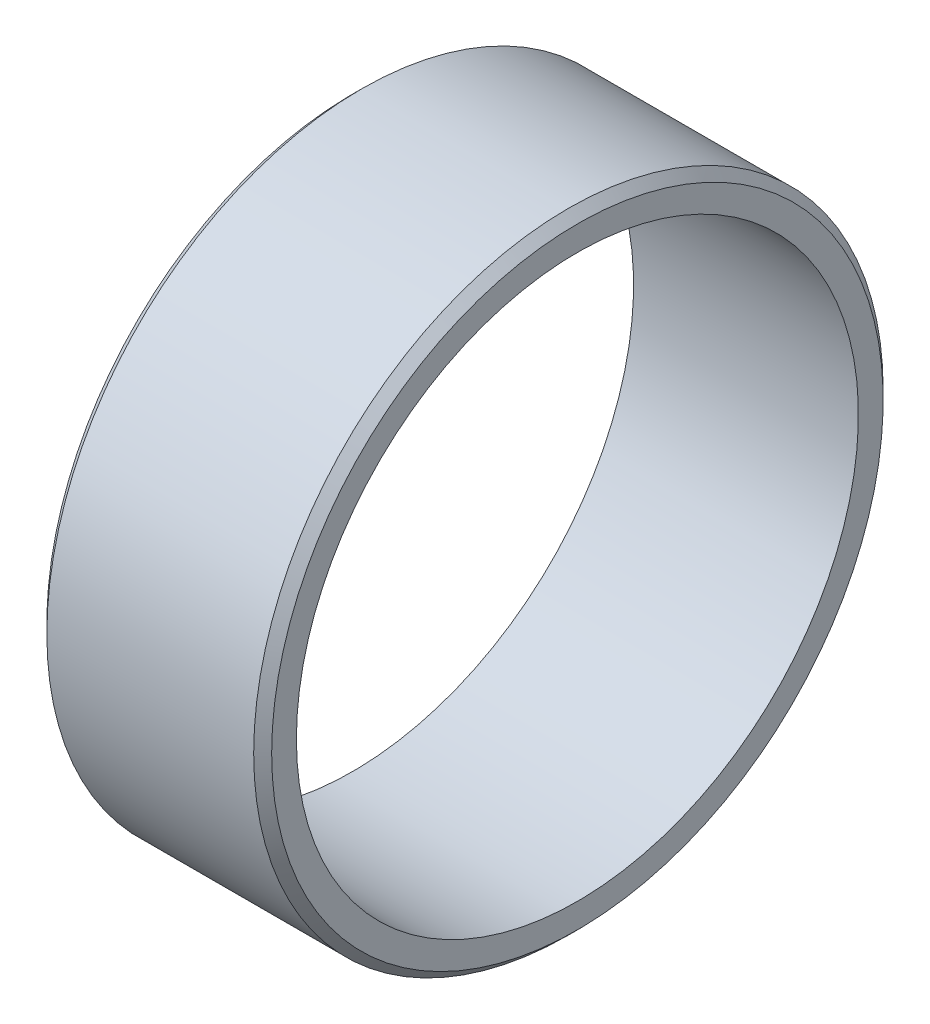
ISO-10303-21;
HEADER;
FILE_DESCRIPTION(('STEP AP214'),'2;1');
FILE_NAME('part.step','',(''),(''),'','','');
FILE_SCHEMA(('AUTOMOTIVE_DESIGN { 1 0 10303 214 1 1 1 1 }'));
ENDSEC;
DATA;
#1=APPLICATION_CONTEXT('core data for automotive mechanical design processes');
#2=APPLICATION_PROTOCOL_DEFINITION('international standard','automotive_design',2000,#1);
#3=PRODUCT_CONTEXT('',#1,'mechanical');
#4=PRODUCT('Part','Part','',(#3));
#5=PRODUCT_RELATED_PRODUCT_CATEGORY('part','',(#4));
#6=PRODUCT_DEFINITION_FORMATION('','',#4);
#7=PRODUCT_DEFINITION_CONTEXT('part definition',#1,'design');
#8=PRODUCT_DEFINITION('design','',#6,#7);
#9=PRODUCT_DEFINITION_SHAPE('','',#8);
#10=(LENGTH_UNIT() NAMED_UNIT(*) SI_UNIT(.MILLI.,.METRE.));
#11=(NAMED_UNIT(*) PLANE_ANGLE_UNIT() SI_UNIT($,.RADIAN.));
#12=(NAMED_UNIT(*) SI_UNIT($,.STERADIAN.) SOLID_ANGLE_UNIT());
#13=UNCERTAINTY_MEASURE_WITH_UNIT(LENGTH_MEASURE(1.E-05),#10,'distance_accuracy_value','');
#14=(GEOMETRIC_REPRESENTATION_CONTEXT(3) GLOBAL_UNCERTAINTY_ASSIGNED_CONTEXT((#13)) GLOBAL_UNIT_ASSIGNED_CONTEXT((#10,
#11,#12)) REPRESENTATION_CONTEXT('',''));
#15=CARTESIAN_POINT('',(0.,0.,0.));
#16=DIRECTION('',(0.,0.,1.));
#17=DIRECTION('',(1.,0.,0.));
#18=AXIS2_PLACEMENT_3D('',#15,#16,#17);
#19=CARTESIAN_POINT('',(-4.99999999999999,12.5,0.));
#20=DIRECTION('',(1.,0.,0.));
#21=DIRECTION('',(0.,0.,-1.));
#22=AXIS2_PLACEMENT_3D('',#19,#20,#21);
#23=PLANE('',#22);
#24=CARTESIAN_POINT('',(-4.99999999999999,0.,0.));
#25=DIRECTION('',(1.,0.,0.));
#26=DIRECTION('',(0.,0.,-1.));
#27=AXIS2_PLACEMENT_3D('',#24,#25,#26);
#28=CIRCLE('',#27,13.6);
#29=CARTESIAN_POINT('',(-4.99999999999999,0.,-13.6));
#30=VERTEX_POINT('',#29);
#31=EDGE_CURVE('E46',#30,#30,#28,.F.);
#32=ORIENTED_EDGE('',*,*,#31,.T.);
#33=EDGE_LOOP('',(#32));
#34=FACE_BOUND('',#33,.T.);
#35=CARTESIAN_POINT('',(-4.99999999999999,0.,0.));
#36=DIRECTION('',(-1.,0.,0.));
#37=DIRECTION('',(0.,0.,1.));
#38=AXIS2_PLACEMENT_3D('',#35,#36,#37);
#39=CIRCLE('',#38,12.5);
#40=CARTESIAN_POINT('',(-4.99999999999999,0.,12.5));
#41=VERTEX_POINT('',#40);
#42=EDGE_CURVE('E51',#41,#41,#39,.T.);
#43=ORIENTED_EDGE('',*,*,#42,.F.);
#44=EDGE_LOOP('',(#43));
#45=FACE_BOUND('',#44,.T.);
#46=ADVANCED_FACE('F31',(#34,#45),#23,.F.);
#47=CARTESIAN_POINT('',(0.,0.,0.));
#48=DIRECTION('',(-1.,0.,0.));
#49=DIRECTION('',(0.,0.,1.));
#50=AXIS2_PLACEMENT_3D('',#47,#48,#49);
#51=CYLINDRICAL_SURFACE('',#50,12.5);
#52=CARTESIAN_POINT('',(5.00000000000001,0.,0.));
#53=DIRECTION('',(-1.,0.,0.));
#54=DIRECTION('',(0.,0.,1.));
#55=AXIS2_PLACEMENT_3D('',#52,#53,#54);
#56=CIRCLE('',#55,12.5);
#57=CARTESIAN_POINT('',(5.00000000000001,0.,12.5));
#58=VERTEX_POINT('',#57);
#59=EDGE_CURVE('E54',#58,#58,#56,.T.);
#60=ORIENTED_EDGE('',*,*,#59,.F.);
#61=EDGE_LOOP('',(#60));
#62=FACE_BOUND('',#61,.T.);
#63=ORIENTED_EDGE('',*,*,#42,.T.);
#64=EDGE_LOOP('',(#63));
#65=FACE_BOUND('',#64,.T.);
#66=ADVANCED_FACE('F60',(#62,#65),#51,.F.);
#67=CARTESIAN_POINT('',(5.00000000000001,12.5,0.));
#68=DIRECTION('',(-1.,0.,0.));
#69=DIRECTION('',(0.,0.,1.));
#70=AXIS2_PLACEMENT_3D('',#67,#68,#69);
#71=PLANE('',#70);
#72=CARTESIAN_POINT('',(5.00000000000001,0.,0.));
#73=DIRECTION('',(-1.,0.,0.));
#74=DIRECTION('',(0.,0.,1.));
#75=AXIS2_PLACEMENT_3D('',#72,#73,#74);
#76=CIRCLE('',#75,13.6);
#77=CARTESIAN_POINT('',(5.00000000000001,0.,13.6));
#78=VERTEX_POINT('',#77);
#79=EDGE_CURVE('E10',#78,#78,#76,.F.);
#80=ORIENTED_EDGE('',*,*,#79,.T.);
#81=EDGE_LOOP('',(#80));
#82=FACE_BOUND('',#81,.T.);
#83=ORIENTED_EDGE('',*,*,#59,.T.);
#84=EDGE_LOOP('',(#83));
#85=FACE_BOUND('',#84,.T.);
#86=ADVANCED_FACE('F58',(#82,#85),#71,.F.);
#87=CARTESIAN_POINT('',(0.,0.,0.));
#88=DIRECTION('',(-1.,0.,0.));
#89=DIRECTION('',(0.,0.,1.));
#90=AXIS2_PLACEMENT_3D('',#87,#88,#89);
#91=CYLINDRICAL_SURFACE('',#90,14.);
#92=CARTESIAN_POINT('',(-4.59999999999998,0.,0.));
#93=DIRECTION('',(1.,0.,0.));
#94=DIRECTION('',(0.,0.,-1.));
#95=AXIS2_PLACEMENT_3D('',#92,#93,#94);
#96=CIRCLE('',#95,14.);
#97=CARTESIAN_POINT('',(-4.59999999999998,0.,-14.));
#98=VERTEX_POINT('',#97);
#99=EDGE_CURVE('E38',#98,#98,#96,.T.);
#100=ORIENTED_EDGE('',*,*,#99,.T.);
#101=EDGE_LOOP('',(#100));
#102=FACE_BOUND('',#101,.T.);
#103=CARTESIAN_POINT('',(4.60000000000002,0.,0.));
#104=DIRECTION('',(-1.,0.,0.));
#105=DIRECTION('',(0.,0.,1.));
#106=AXIS2_PLACEMENT_3D('',#103,#104,#105);
#107=CIRCLE('',#106,14.);
#108=CARTESIAN_POINT('',(4.60000000000002,0.,14.));
#109=VERTEX_POINT('',#108);
#110=EDGE_CURVE('E42',#109,#109,#107,.T.);
#111=ORIENTED_EDGE('',*,*,#110,.T.);
#112=EDGE_LOOP('',(#111));
#113=FACE_BOUND('',#112,.T.);
#114=ADVANCED_FACE('F74',(#102,#113),#91,.T.);
#115=CARTESIAN_POINT('',(-4.99999999999999,0.,0.));
#116=DIRECTION('',(1.,0.,0.));
#117=DIRECTION('',(0.,0.,-1.));
#118=AXIS2_PLACEMENT_3D('',#115,#116,#117);
#119=CONICAL_SURFACE('',#118,13.6,0.785398163397446);
#120=ORIENTED_EDGE('',*,*,#99,.F.);
#121=EDGE_LOOP('',(#120));
#122=FACE_BOUND('',#121,.T.);
#123=ORIENTED_EDGE('',*,*,#31,.F.);
#124=EDGE_LOOP('',(#123));
#125=FACE_BOUND('',#124,.T.);
#126=ADVANCED_FACE('F72',(#122,#125),#119,.T.);
#127=CARTESIAN_POINT('',(4.60000000000002,0.,0.));
#128=DIRECTION('',(-1.,0.,0.));
#129=DIRECTION('',(0.,0.,1.));
#130=AXIS2_PLACEMENT_3D('',#127,#128,#129);
#131=CONICAL_SURFACE('',#130,14.,0.78539816339745);
#132=ORIENTED_EDGE('',*,*,#79,.F.);
#133=EDGE_LOOP('',(#132));
#134=FACE_BOUND('',#133,.T.);
#135=ORIENTED_EDGE('',*,*,#110,.F.);
#136=EDGE_LOOP('',(#135));
#137=FACE_BOUND('',#136,.T.);
#138=ADVANCED_FACE('F33',(#134,#137),#131,.T.);
#139=CLOSED_SHELL('',(#46,#66,#86,#114,#126,#138));
#140=MANIFOLD_SOLID_BREP('B2',#139);
#141=ADVANCED_BREP_SHAPE_REPRESENTATION('',(#18,#140),#14);
#142=SHAPE_DEFINITION_REPRESENTATION(#9,#141);
ENDSEC;
END-ISO-10303-21;
